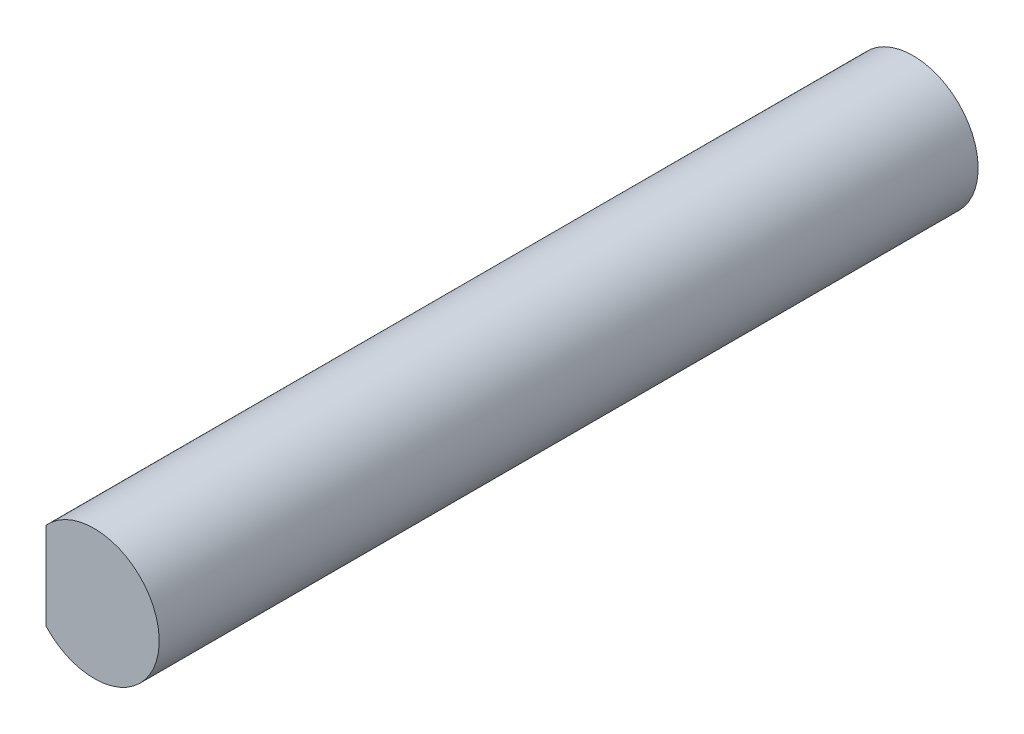
ISO-10303-21;
HEADER;
FILE_DESCRIPTION(('STEP AP214'),'2;1');
FILE_NAME('part.step','',(''),(''),'','','');
FILE_SCHEMA(('AUTOMOTIVE_DESIGN { 1 0 10303 214 1 1 1 1 }'));
ENDSEC;
DATA;
#1=APPLICATION_CONTEXT('core data for automotive mechanical design processes');
#2=APPLICATION_PROTOCOL_DEFINITION('international standard','automotive_design',2000,#1);
#3=PRODUCT_CONTEXT('',#1,'mechanical');
#4=PRODUCT('Part','Part','',(#3));
#5=PRODUCT_RELATED_PRODUCT_CATEGORY('part','',(#4));
#6=PRODUCT_DEFINITION_FORMATION('','',#4);
#7=PRODUCT_DEFINITION_CONTEXT('part definition',#1,'design');
#8=PRODUCT_DEFINITION('design','',#6,#7);
#9=PRODUCT_DEFINITION_SHAPE('','',#8);
#10=(LENGTH_UNIT() NAMED_UNIT(*) SI_UNIT(.MILLI.,.METRE.));
#11=(NAMED_UNIT(*) PLANE_ANGLE_UNIT() SI_UNIT($,.RADIAN.));
#12=(NAMED_UNIT(*) SI_UNIT($,.STERADIAN.) SOLID_ANGLE_UNIT());
#13=UNCERTAINTY_MEASURE_WITH_UNIT(LENGTH_MEASURE(1.E-05),#10,'distance_accuracy_value','');
#14=(GEOMETRIC_REPRESENTATION_CONTEXT(3) GLOBAL_UNCERTAINTY_ASSIGNED_CONTEXT((#13)) GLOBAL_UNIT_ASSIGNED_CONTEXT((#10,
#11,#12)) REPRESENTATION_CONTEXT('',''));
#15=CARTESIAN_POINT('',(0.,0.,0.));
#16=DIRECTION('',(0.,0.,1.));
#17=DIRECTION('',(1.,0.,0.));
#18=AXIS2_PLACEMENT_3D('',#15,#16,#17);
#19=CARTESIAN_POINT('',(0.,0.,8.5));
#20=DIRECTION('',(0.,0.,-1.));
#21=DIRECTION('',(-1.,0.,0.));
#22=AXIS2_PLACEMENT_3D('',#19,#20,#21);
#23=CYLINDRICAL_SURFACE('',#22,1.35);
#24=CARTESIAN_POINT('',(0.,0.,8.5));
#25=DIRECTION('',(0.,0.,1.));
#26=DIRECTION('',(1.,0.,0.));
#27=AXIS2_PLACEMENT_3D('',#24,#25,#26);
#28=CIRCLE('',#27,1.35);
#29=CARTESIAN_POINT('',(-1.,-0.906917857360853,8.5));
#30=VERTEX_POINT('',#29);
#31=CARTESIAN_POINT('',(-1.,0.906917857360853,8.5));
#32=VERTEX_POINT('',#31);
#33=EDGE_CURVE('E11',#30,#32,#28,.T.);
#34=ORIENTED_EDGE('',*,*,#33,.F.);
#35=DIRECTION('',(0.,0.,1.));
#36=VECTOR('',#35,1.);
#37=CARTESIAN_POINT('',(-1.,-0.906917857360853,5.3));
#38=LINE('',#37,#36);
#39=CARTESIAN_POINT('',(-1.,-0.906917857360853,5.3));
#40=VERTEX_POINT('',#39);
#41=EDGE_CURVE('E51',#40,#30,#38,.T.);
#42=ORIENTED_EDGE('',*,*,#41,.F.);
#43=CARTESIAN_POINT('',(0.,0.,5.3));
#44=DIRECTION('',(0.,0.,1.));
#45=DIRECTION('',(1.,0.,0.));
#46=AXIS2_PLACEMENT_3D('',#43,#44,#45);
#47=CIRCLE('',#46,1.35);
#48=CARTESIAN_POINT('',(-1.,0.906917857360853,5.3));
#49=VERTEX_POINT('',#48);
#50=EDGE_CURVE('E79',#49,#40,#47,.T.);
#51=ORIENTED_EDGE('',*,*,#50,.F.);
#52=DIRECTION('',(0.,0.,1.));
#53=VECTOR('',#52,1.);
#54=CARTESIAN_POINT('',(-1.,0.906917857360853,5.3));
#55=LINE('',#54,#53);
#56=EDGE_CURVE('E87',#49,#32,#55,.T.);
#57=ORIENTED_EDGE('',*,*,#56,.T.);
#58=EDGE_LOOP('',(#34,#42,#51,#57));
#59=FACE_BOUND('',#58,.T.);
#60=CARTESIAN_POINT('',(0.,0.,-2.1));
#61=DIRECTION('',(0.,0.,-1.));
#62=DIRECTION('',(-1.,0.,0.));
#63=AXIS2_PLACEMENT_3D('',#60,#61,#62);
#64=CIRCLE('',#63,1.35);
#65=CARTESIAN_POINT('',(-1.,-0.906917857360853,-2.1));
#66=VERTEX_POINT('',#65);
#67=CARTESIAN_POINT('',(-1.,0.906917857360853,-2.1));
#68=VERTEX_POINT('',#67);
#69=EDGE_CURVE('E96',#66,#68,#64,.T.);
#70=ORIENTED_EDGE('',*,*,#69,.F.);
#71=DIRECTION('',(0.,0.,-1.));
#72=VECTOR('',#71,1.);
#73=CARTESIAN_POINT('',(-1.,-0.906917857360853,-2.1));
#74=LINE('',#73,#72);
#75=CARTESIAN_POINT('',(-1.,-0.906917857360853,-8.5));
#76=VERTEX_POINT('',#75);
#77=EDGE_CURVE('E102',#66,#76,#74,.T.);
#78=ORIENTED_EDGE('',*,*,#77,.T.);
#79=CARTESIAN_POINT('',(0.,0.,-8.5));
#80=DIRECTION('',(0.,0.,1.));
#81=DIRECTION('',(1.,0.,0.));
#82=AXIS2_PLACEMENT_3D('',#79,#80,#81);
#83=CIRCLE('',#82,1.35);
#84=CARTESIAN_POINT('',(-1.,0.906917857360853,-8.5));
#85=VERTEX_POINT('',#84);
#86=EDGE_CURVE('E40',#76,#85,#83,.T.);
#87=ORIENTED_EDGE('',*,*,#86,.T.);
#88=DIRECTION('',(0.,0.,-1.));
#89=VECTOR('',#88,1.);
#90=CARTESIAN_POINT('',(-1.,0.906917857360853,-2.1));
#91=LINE('',#90,#89);
#92=EDGE_CURVE('E59',#68,#85,#91,.T.);
#93=ORIENTED_EDGE('',*,*,#92,.F.);
#94=EDGE_LOOP('',(#70,#78,#87,#93));
#95=FACE_BOUND('',#94,.T.);
#96=ADVANCED_FACE('F37',(#59,#95),#23,.T.);
#97=CARTESIAN_POINT('',(0.,0.,8.5));
#98=DIRECTION('',(0.,0.,1.));
#99=DIRECTION('',(1.,0.,0.));
#100=AXIS2_PLACEMENT_3D('',#97,#98,#99);
#101=PLANE('',#100);
#102=DIRECTION('',(0.,1.,0.));
#103=VECTOR('',#102,1.);
#104=CARTESIAN_POINT('',(-1.,0.906917857360853,8.5));
#105=LINE('',#104,#103);
#106=EDGE_CURVE('E84',#30,#32,#105,.T.);
#107=ORIENTED_EDGE('',*,*,#106,.F.);
#108=ORIENTED_EDGE('',*,*,#33,.T.);
#109=EDGE_LOOP('',(#107,#108));
#110=FACE_BOUND('',#109,.T.);
#111=ADVANCED_FACE('F122',(#110),#101,.T.);
#112=CARTESIAN_POINT('',(0.,0.,-8.5));
#113=DIRECTION('',(0.,0.,1.));
#114=DIRECTION('',(1.,0.,0.));
#115=AXIS2_PLACEMENT_3D('',#112,#113,#114);
#116=PLANE('',#115);
#117=ORIENTED_EDGE('',*,*,#86,.F.);
#118=DIRECTION('',(0.,-1.,0.));
#119=VECTOR('',#118,1.);
#120=CARTESIAN_POINT('',(-1.,0.906917857360853,-8.5));
#121=LINE('',#120,#119);
#122=EDGE_CURVE('E92',#85,#76,#121,.T.);
#123=ORIENTED_EDGE('',*,*,#122,.F.);
#124=EDGE_LOOP('',(#117,#123));
#125=FACE_BOUND('',#124,.T.);
#126=ADVANCED_FACE('F109',(#125),#116,.F.);
#127=CARTESIAN_POINT('',(-1.,0.906917857360853,-2.1));
#128=DIRECTION('',(1.,0.,0.));
#129=DIRECTION('',(0.,0.,-1.));
#130=AXIS2_PLACEMENT_3D('',#127,#128,#129);
#131=PLANE('',#130);
#132=ORIENTED_EDGE('',*,*,#122,.T.);
#133=ORIENTED_EDGE('',*,*,#77,.F.);
#134=DIRECTION('',(0.,-1.,0.));
#135=VECTOR('',#134,1.);
#136=CARTESIAN_POINT('',(-1.,0.906917857360853,-2.1));
#137=LINE('',#136,#135);
#138=EDGE_CURVE('E98',#68,#66,#137,.T.);
#139=ORIENTED_EDGE('',*,*,#138,.F.);
#140=ORIENTED_EDGE('',*,*,#92,.T.);
#141=EDGE_LOOP('',(#132,#133,#139,#140));
#142=FACE_BOUND('',#141,.T.);
#143=ADVANCED_FACE('F110',(#142),#131,.F.);
#144=CARTESIAN_POINT('',(0.,0.,-2.1));
#145=DIRECTION('',(0.,0.,-1.));
#146=DIRECTION('',(-1.,0.,0.));
#147=AXIS2_PLACEMENT_3D('',#144,#145,#146);
#148=PLANE('',#147);
#149=ORIENTED_EDGE('',*,*,#69,.T.);
#150=ORIENTED_EDGE('',*,*,#138,.T.);
#151=EDGE_LOOP('',(#149,#150));
#152=FACE_BOUND('',#151,.T.);
#153=ADVANCED_FACE('F112',(#152),#148,.T.);
#154=CARTESIAN_POINT('',(-1.,0.906917857360853,5.3));
#155=DIRECTION('',(1.,0.,0.));
#156=DIRECTION('',(0.,0.,-1.));
#157=AXIS2_PLACEMENT_3D('',#154,#155,#156);
#158=PLANE('',#157);
#159=ORIENTED_EDGE('',*,*,#106,.T.);
#160=ORIENTED_EDGE('',*,*,#56,.F.);
#161=DIRECTION('',(0.,1.,0.));
#162=VECTOR('',#161,1.);
#163=CARTESIAN_POINT('',(-1.,0.906917857360853,5.3));
#164=LINE('',#163,#162);
#165=EDGE_CURVE('E81',#40,#49,#164,.T.);
#166=ORIENTED_EDGE('',*,*,#165,.F.);
#167=ORIENTED_EDGE('',*,*,#41,.T.);
#168=EDGE_LOOP('',(#159,#160,#166,#167));
#169=FACE_BOUND('',#168,.T.);
#170=ADVANCED_FACE('F86',(#169),#158,.F.);
#171=CARTESIAN_POINT('',(0.,0.,5.3));
#172=DIRECTION('',(0.,0.,1.));
#173=DIRECTION('',(1.,0.,0.));
#174=AXIS2_PLACEMENT_3D('',#171,#172,#173);
#175=PLANE('',#174);
#176=ORIENTED_EDGE('',*,*,#50,.T.);
#177=ORIENTED_EDGE('',*,*,#165,.T.);
#178=EDGE_LOOP('',(#176,#177));
#179=FACE_BOUND('',#178,.T.);
#180=ADVANCED_FACE('F80',(#179),#175,.T.);
#181=CLOSED_SHELL('',(#96,#111,#126,#143,#153,#170,#180));
#182=MANIFOLD_SOLID_BREP('B2',#181);
#183=ADVANCED_BREP_SHAPE_REPRESENTATION('',(#18,#182),#14);
#184=SHAPE_DEFINITION_REPRESENTATION(#9,#183);
ENDSEC;
END-ISO-10303-21;
